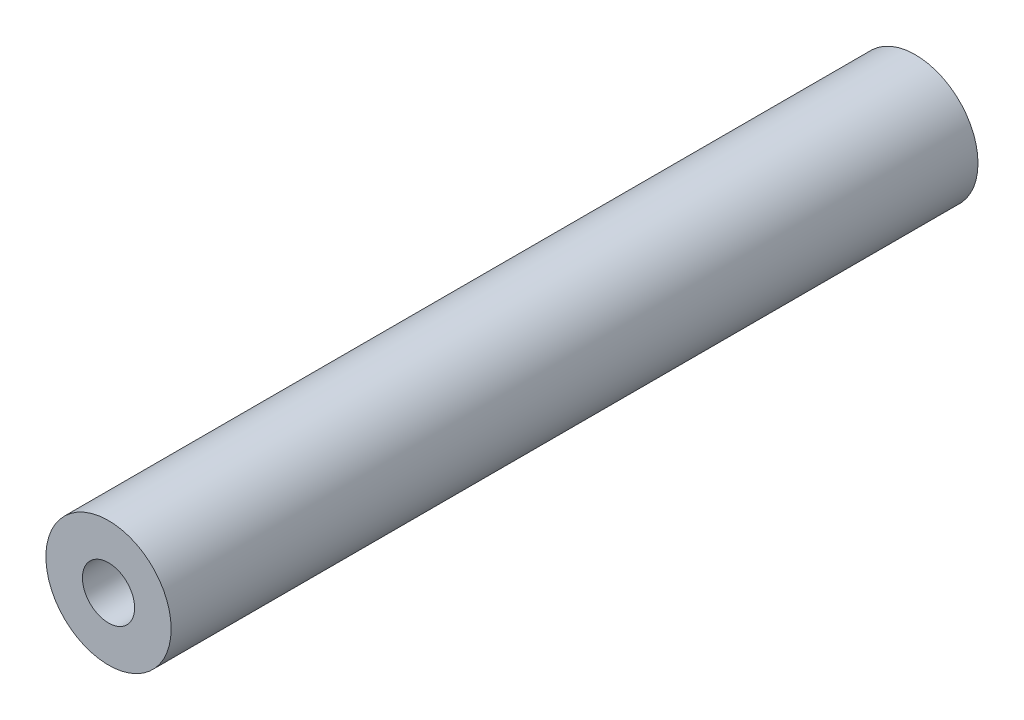
ISO-10303-21;
HEADER;
FILE_DESCRIPTION(('STEP AP214'),'2;1');
FILE_NAME('part.step','',(''),(''),'','','');
FILE_SCHEMA(('AUTOMOTIVE_DESIGN { 1 0 10303 214 1 1 1 1 }'));
ENDSEC;
DATA;
#1=APPLICATION_CONTEXT('core data for automotive mechanical design processes');
#2=APPLICATION_PROTOCOL_DEFINITION('international standard','automotive_design',2000,#1);
#3=PRODUCT_CONTEXT('',#1,'mechanical');
#4=PRODUCT('Part','Part','',(#3));
#5=PRODUCT_RELATED_PRODUCT_CATEGORY('part','',(#4));
#6=PRODUCT_DEFINITION_FORMATION('','',#4);
#7=PRODUCT_DEFINITION_CONTEXT('part definition',#1,'design');
#8=PRODUCT_DEFINITION('design','',#6,#7);
#9=PRODUCT_DEFINITION_SHAPE('','',#8);
#10=(LENGTH_UNIT() NAMED_UNIT(*) SI_UNIT(.MILLI.,.METRE.));
#11=(NAMED_UNIT(*) PLANE_ANGLE_UNIT() SI_UNIT($,.RADIAN.));
#12=(NAMED_UNIT(*) SI_UNIT($,.STERADIAN.) SOLID_ANGLE_UNIT());
#13=UNCERTAINTY_MEASURE_WITH_UNIT(LENGTH_MEASURE(1.E-05),#10,'distance_accuracy_value','');
#14=(GEOMETRIC_REPRESENTATION_CONTEXT(3) GLOBAL_UNCERTAINTY_ASSIGNED_CONTEXT((#13)) GLOBAL_UNIT_ASSIGNED_CONTEXT((#10,
#11,#12)) REPRESENTATION_CONTEXT('',''));
#15=CARTESIAN_POINT('',(0.,0.,0.));
#16=DIRECTION('',(0.,0.,1.));
#17=DIRECTION('',(1.,0.,0.));
#18=AXIS2_PLACEMENT_3D('',#15,#16,#17);
#19=CARTESIAN_POINT('',(0.,0.,19.325));
#20=DIRECTION('',(0.,0.,-1.));
#21=DIRECTION('',(-1.,0.,0.));
#22=AXIS2_PLACEMENT_3D('',#19,#20,#21);
#23=CYLINDRICAL_SURFACE('',#22,3.);
#24=CARTESIAN_POINT('',(0.,0.,19.325));
#25=DIRECTION('',(0.,0.,1.));
#26=DIRECTION('',(1.,0.,0.));
#27=AXIS2_PLACEMENT_3D('',#24,#25,#26);
#28=CIRCLE('',#27,3.);
#29=CARTESIAN_POINT('',(3.,0.,19.325));
#30=VERTEX_POINT('',#29);
#31=EDGE_CURVE('E11',#30,#30,#28,.T.);
#32=ORIENTED_EDGE('',*,*,#31,.F.);
#33=EDGE_LOOP('',(#32));
#34=FACE_BOUND('',#33,.T.);
#35=CARTESIAN_POINT('',(0.,0.,-19.325));
#36=DIRECTION('',(0.,0.,1.));
#37=DIRECTION('',(1.,0.,0.));
#38=AXIS2_PLACEMENT_3D('',#35,#36,#37);
#39=CIRCLE('',#38,3.);
#40=CARTESIAN_POINT('',(3.,0.,-19.325));
#41=VERTEX_POINT('',#40);
#42=EDGE_CURVE('E40',#41,#41,#39,.T.);
#43=ORIENTED_EDGE('',*,*,#42,.T.);
#44=EDGE_LOOP('',(#43));
#45=FACE_BOUND('',#44,.T.);
#46=ADVANCED_FACE('F37',(#34,#45),#23,.T.);
#47=CARTESIAN_POINT('',(0.,0.,19.325));
#48=DIRECTION('',(0.,0.,1.));
#49=DIRECTION('',(1.,0.,0.));
#50=AXIS2_PLACEMENT_3D('',#47,#48,#49);
#51=PLANE('',#50);
#52=CARTESIAN_POINT('',(0.,0.,19.325));
#53=DIRECTION('',(0.,0.,1.));
#54=DIRECTION('',(1.,0.,0.));
#55=AXIS2_PLACEMENT_3D('',#52,#53,#54);
#56=CIRCLE('',#55,1.24999999999999);
#57=CARTESIAN_POINT('',(1.24999999999999,0.,19.325));
#58=VERTEX_POINT('',#57);
#59=EDGE_CURVE('E61',#58,#58,#56,.T.);
#60=ORIENTED_EDGE('',*,*,#59,.F.);
#61=EDGE_LOOP('',(#60));
#62=FACE_BOUND('',#61,.T.);
#63=ORIENTED_EDGE('',*,*,#31,.T.);
#64=EDGE_LOOP('',(#63));
#65=FACE_BOUND('',#64,.T.);
#66=ADVANCED_FACE('F79',(#62,#65),#51,.T.);
#67=CARTESIAN_POINT('',(0.,0.,-19.325));
#68=DIRECTION('',(0.,0.,1.));
#69=DIRECTION('',(1.,0.,0.));
#70=AXIS2_PLACEMENT_3D('',#67,#68,#69);
#71=PLANE('',#70);
#72=CARTESIAN_POINT('',(0.,0.,-19.325));
#73=DIRECTION('',(0.,0.,-1.));
#74=DIRECTION('',(-1.,0.,0.));
#75=AXIS2_PLACEMENT_3D('',#72,#73,#74);
#76=CIRCLE('',#75,1.24999999999999);
#77=CARTESIAN_POINT('',(-1.24999999999999,0.,-19.325));
#78=VERTEX_POINT('',#77);
#79=EDGE_CURVE('E60',#78,#78,#76,.T.);
#80=ORIENTED_EDGE('',*,*,#79,.F.);
#81=EDGE_LOOP('',(#80));
#82=FACE_BOUND('',#81,.T.);
#83=ORIENTED_EDGE('',*,*,#42,.F.);
#84=EDGE_LOOP('',(#83));
#85=FACE_BOUND('',#84,.T.);
#86=ADVANCED_FACE('F76',(#82,#85),#71,.F.);
#87=CARTESIAN_POINT('',(0.,0.,-10.825));
#88=DIRECTION('',(0.,0.,-1.));
#89=DIRECTION('',(-1.,0.,0.));
#90=AXIS2_PLACEMENT_3D('',#87,#88,#89);
#91=CONICAL_SURFACE('',#90,1.24999999999999,1.02974425867665);
#92=CARTESIAN_POINT('',(0.,0.,-10.0739242262156));
#93=VERTEX_POINT('',#92);
#94=VERTEX_LOOP('',#93);
#95=FACE_BOUND('',#94,.T.);
#96=CARTESIAN_POINT('',(0.,0.,-10.825));
#97=DIRECTION('',(0.,0.,-1.));
#98=DIRECTION('',(-1.,0.,0.));
#99=AXIS2_PLACEMENT_3D('',#96,#97,#98);
#100=CIRCLE('',#99,1.24999999999999);
#101=CARTESIAN_POINT('',(-1.24999999999999,0.,-10.825));
#102=VERTEX_POINT('',#101);
#103=EDGE_CURVE('E64',#102,#102,#100,.T.);
#104=ORIENTED_EDGE('',*,*,#103,.T.);
#105=EDGE_LOOP('',(#104));
#106=FACE_BOUND('',#105,.T.);
#107=ADVANCED_FACE('F78',(#95,#106),#91,.F.);
#108=CARTESIAN_POINT('',(0.,0.,-19.325));
#109=DIRECTION('',(0.,0.,-1.));
#110=DIRECTION('',(-1.,0.,0.));
#111=AXIS2_PLACEMENT_3D('',#108,#109,#110);
#112=CYLINDRICAL_SURFACE('',#111,1.24999999999999);
#113=ORIENTED_EDGE('',*,*,#103,.F.);
#114=EDGE_LOOP('',(#113));
#115=FACE_BOUND('',#114,.T.);
#116=ORIENTED_EDGE('',*,*,#79,.T.);
#117=EDGE_LOOP('',(#116));
#118=FACE_BOUND('',#117,.T.);
#119=ADVANCED_FACE('F54',(#115,#118),#112,.F.);
#120=CARTESIAN_POINT('',(0.,0.,10.825));
#121=DIRECTION('',(0.,0.,1.));
#122=DIRECTION('',(1.,0.,0.));
#123=AXIS2_PLACEMENT_3D('',#120,#121,#122);
#124=CONICAL_SURFACE('',#123,1.24999999999999,1.02974425867665);
#125=CARTESIAN_POINT('',(0.,0.,10.0739242262156));
#126=VERTEX_POINT('',#125);
#127=VERTEX_LOOP('',#126);
#128=FACE_BOUND('',#127,.T.);
#129=CARTESIAN_POINT('',(0.,0.,10.825));
#130=DIRECTION('',(0.,0.,1.));
#131=DIRECTION('',(1.,0.,0.));
#132=AXIS2_PLACEMENT_3D('',#129,#130,#131);
#133=CIRCLE('',#132,1.24999999999999);
#134=CARTESIAN_POINT('',(1.24999999999999,0.,10.825));
#135=VERTEX_POINT('',#134);
#136=EDGE_CURVE('E58',#135,#135,#133,.T.);
#137=ORIENTED_EDGE('',*,*,#136,.T.);
#138=EDGE_LOOP('',(#137));
#139=FACE_BOUND('',#138,.T.);
#140=ADVANCED_FACE('F50',(#128,#139),#124,.F.);
#141=CARTESIAN_POINT('',(0.,0.,19.325));
#142=DIRECTION('',(0.,0.,1.));
#143=DIRECTION('',(1.,0.,0.));
#144=AXIS2_PLACEMENT_3D('',#141,#142,#143);
#145=CYLINDRICAL_SURFACE('',#144,1.24999999999999);
#146=ORIENTED_EDGE('',*,*,#136,.F.);
#147=EDGE_LOOP('',(#146));
#148=FACE_BOUND('',#147,.T.);
#149=ORIENTED_EDGE('',*,*,#59,.T.);
#150=EDGE_LOOP('',(#149));
#151=FACE_BOUND('',#150,.T.);
#152=ADVANCED_FACE('F53',(#148,#151),#145,.F.);
#153=CLOSED_SHELL('',(#46,#66,#86,#107,#119,#140,#152));
#154=MANIFOLD_SOLID_BREP('B2',#153);
#155=ADVANCED_BREP_SHAPE_REPRESENTATION('',(#18,#154),#14);
#156=SHAPE_DEFINITION_REPRESENTATION(#9,#155);
ENDSEC;
END-ISO-10303-21;
